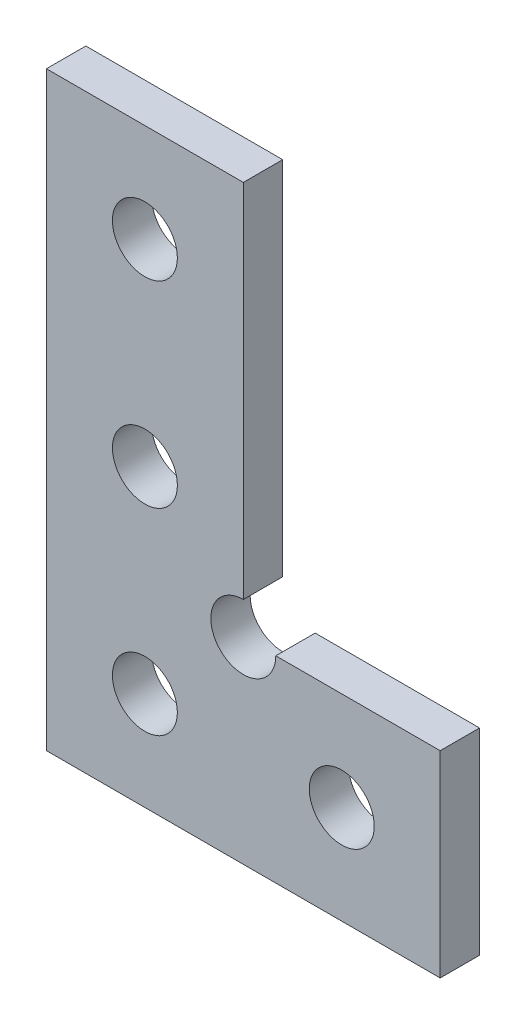
ISO-10303-21;
HEADER;
FILE_DESCRIPTION(('STEP AP214'),'2;1');
FILE_NAME('part.step','',(''),(''),'','','');
FILE_SCHEMA(('AUTOMOTIVE_DESIGN { 1 0 10303 214 1 1 1 1 }'));
ENDSEC;
DATA;
#1=APPLICATION_CONTEXT('core data for automotive mechanical design processes');
#2=APPLICATION_PROTOCOL_DEFINITION('international standard','automotive_design',2000,#1);
#3=PRODUCT_CONTEXT('',#1,'mechanical');
#4=PRODUCT('Part','Part','',(#3));
#5=PRODUCT_RELATED_PRODUCT_CATEGORY('part','',(#4));
#6=PRODUCT_DEFINITION_FORMATION('','',#4);
#7=PRODUCT_DEFINITION_CONTEXT('part definition',#1,'design');
#8=PRODUCT_DEFINITION('design','',#6,#7);
#9=PRODUCT_DEFINITION_SHAPE('','',#8);
#10=(LENGTH_UNIT() NAMED_UNIT(*) SI_UNIT(.MILLI.,.METRE.));
#11=(NAMED_UNIT(*) PLANE_ANGLE_UNIT() SI_UNIT($,.RADIAN.));
#12=(NAMED_UNIT(*) SI_UNIT($,.STERADIAN.) SOLID_ANGLE_UNIT());
#13=UNCERTAINTY_MEASURE_WITH_UNIT(LENGTH_MEASURE(1.E-05),#10,'distance_accuracy_value','');
#14=(GEOMETRIC_REPRESENTATION_CONTEXT(3) GLOBAL_UNCERTAINTY_ASSIGNED_CONTEXT((#13)) GLOBAL_UNIT_ASSIGNED_CONTEXT((#10,
#11,#12)) REPRESENTATION_CONTEXT('',''));
#15=CARTESIAN_POINT('',(0.,0.,0.));
#16=DIRECTION('',(0.,0.,1.));
#17=DIRECTION('',(1.,0.,0.));
#18=AXIS2_PLACEMENT_3D('',#15,#16,#17);
#19=CARTESIAN_POINT('',(0.,-5.,1.));
#20=DIRECTION('',(0.,0.,1.));
#21=DIRECTION('',(1.,0.,0.));
#22=AXIS2_PLACEMENT_3D('',#19,#20,#21);
#23=PLANE('',#22);
#24=CARTESIAN_POINT('',(5.,-10.,1.));
#25=DIRECTION('',(0.,0.,1.));
#26=DIRECTION('',(1.,0.,0.));
#27=AXIS2_PLACEMENT_3D('',#24,#25,#26);
#28=CIRCLE('',#27,1.65);
#29=CARTESIAN_POINT('',(6.65,-10.,1.));
#30=VERTEX_POINT('',#29);
#31=EDGE_CURVE('E171',#30,#30,#28,.T.);
#32=ORIENTED_EDGE('',*,*,#31,.F.);
#33=EDGE_LOOP('',(#32));
#34=FACE_BOUND('',#33,.T.);
#35=CARTESIAN_POINT('',(-5.,10.,1.));
#36=DIRECTION('',(0.,0.,1.));
#37=DIRECTION('',(1.,0.,0.));
#38=AXIS2_PLACEMENT_3D('',#35,#36,#37);
#39=CIRCLE('',#38,1.65);
#40=CARTESIAN_POINT('',(-3.35,10.,1.));
#41=VERTEX_POINT('',#40);
#42=EDGE_CURVE('E129',#41,#41,#39,.T.);
#43=ORIENTED_EDGE('',*,*,#42,.F.);
#44=EDGE_LOOP('',(#43));
#45=FACE_BOUND('',#44,.T.);
#46=DIRECTION('',(-1.,0.,0.));
#47=VECTOR('',#46,1.);
#48=CARTESIAN_POINT('',(-10.,15.,1.));
#49=LINE('',#48,#47);
#50=CARTESIAN_POINT('',(0.,15.,1.));
#51=VERTEX_POINT('',#50);
#52=CARTESIAN_POINT('',(-10.,15.,1.));
#53=VERTEX_POINT('',#52);
#54=EDGE_CURVE('E138',#51,#53,#49,.T.);
#55=ORIENTED_EDGE('',*,*,#54,.T.);
#56=DIRECTION('',(0.,-1.,0.));
#57=VECTOR('',#56,1.);
#58=CARTESIAN_POINT('',(-10.,15.,1.));
#59=LINE('',#58,#57);
#60=CARTESIAN_POINT('',(-10.,-15.,1.));
#61=VERTEX_POINT('',#60);
#62=EDGE_CURVE('E91',#53,#61,#59,.T.);
#63=ORIENTED_EDGE('',*,*,#62,.T.);
#64=DIRECTION('',(1.,0.,0.));
#65=VECTOR('',#64,1.);
#66=CARTESIAN_POINT('',(-10.,-15.,1.));
#67=LINE('',#66,#65);
#68=CARTESIAN_POINT('',(10.,-15.,1.));
#69=VERTEX_POINT('',#68);
#70=EDGE_CURVE('E150',#61,#69,#67,.T.);
#71=ORIENTED_EDGE('',*,*,#70,.T.);
#72=DIRECTION('',(0.,1.,0.));
#73=VECTOR('',#72,1.);
#74=CARTESIAN_POINT('',(10.,-15.,1.));
#75=LINE('',#74,#73);
#76=CARTESIAN_POINT('',(10.,-5.,1.));
#77=VERTEX_POINT('',#76);
#78=EDGE_CURVE('E107',#69,#77,#75,.T.);
#79=ORIENTED_EDGE('',*,*,#78,.T.);
#80=DIRECTION('',(-1.,0.,0.));
#81=VECTOR('',#80,1.);
#82=CARTESIAN_POINT('',(1.65,-5.,1.));
#83=LINE('',#82,#81);
#84=CARTESIAN_POINT('',(1.65,-5.,1.));
#85=VERTEX_POINT('',#84);
#86=EDGE_CURVE('E101',#77,#85,#83,.T.);
#87=ORIENTED_EDGE('',*,*,#86,.T.);
#88=CARTESIAN_POINT('',(0.,-5.,1.));
#89=DIRECTION('',(0.,0.,-1.));
#90=DIRECTION('',(1.,0.,0.));
#91=AXIS2_PLACEMENT_3D('',#88,#89,#90);
#92=CIRCLE('',#91,1.65);
#93=CARTESIAN_POINT('',(0.,-3.35,1.));
#94=VERTEX_POINT('',#93);
#95=EDGE_CURVE('E105',#85,#94,#92,.T.);
#96=ORIENTED_EDGE('',*,*,#95,.T.);
#97=DIRECTION('',(0.,1.,0.));
#98=VECTOR('',#97,1.);
#99=CARTESIAN_POINT('',(0.,15.,1.));
#100=LINE('',#99,#98);
#101=EDGE_CURVE('E51',#94,#51,#100,.T.);
#102=ORIENTED_EDGE('',*,*,#101,.T.);
#103=EDGE_LOOP('',(#55,#63,#71,#79,#87,#96,#102));
#104=FACE_BOUND('',#103,.T.);
#105=CARTESIAN_POINT('',(-5.,0.,1.));
#106=DIRECTION('',(0.,0.,1.));
#107=DIRECTION('',(1.,0.,0.));
#108=AXIS2_PLACEMENT_3D('',#105,#106,#107);
#109=CIRCLE('',#108,1.65);
#110=CARTESIAN_POINT('',(-3.35,0.,1.));
#111=VERTEX_POINT('',#110);
#112=EDGE_CURVE('E165',#111,#111,#109,.T.);
#113=ORIENTED_EDGE('',*,*,#112,.F.);
#114=EDGE_LOOP('',(#113));
#115=FACE_BOUND('',#114,.T.);
#116=CARTESIAN_POINT('',(-5.,-10.,1.));
#117=DIRECTION('',(0.,0.,1.));
#118=DIRECTION('',(1.,0.,0.));
#119=AXIS2_PLACEMENT_3D('',#116,#117,#118);
#120=CIRCLE('',#119,1.65);
#121=CARTESIAN_POINT('',(-3.35,-10.,1.));
#122=VERTEX_POINT('',#121);
#123=EDGE_CURVE('E177',#122,#122,#120,.T.);
#124=ORIENTED_EDGE('',*,*,#123,.F.);
#125=EDGE_LOOP('',(#124));
#126=FACE_BOUND('',#125,.T.);
#127=ADVANCED_FACE('F34',(#34,#45,#104,#115,#126),#23,.T.);
#128=CARTESIAN_POINT('',(0.,-5.,-1.));
#129=DIRECTION('',(0.,0.,1.));
#130=DIRECTION('',(1.,0.,0.));
#131=AXIS2_PLACEMENT_3D('',#128,#129,#130);
#132=PLANE('',#131);
#133=CARTESIAN_POINT('',(5.,-10.,-1.));
#134=DIRECTION('',(0.,0.,1.));
#135=DIRECTION('',(1.,0.,0.));
#136=AXIS2_PLACEMENT_3D('',#133,#134,#135);
#137=CIRCLE('',#136,1.65);
#138=CARTESIAN_POINT('',(6.65,-10.,-1.));
#139=VERTEX_POINT('',#138);
#140=EDGE_CURVE('E174',#139,#139,#137,.T.);
#141=ORIENTED_EDGE('',*,*,#140,.T.);
#142=EDGE_LOOP('',(#141));
#143=FACE_BOUND('',#142,.T.);
#144=CARTESIAN_POINT('',(-5.,10.,-1.));
#145=DIRECTION('',(0.,0.,1.));
#146=DIRECTION('',(1.,0.,0.));
#147=AXIS2_PLACEMENT_3D('',#144,#145,#146);
#148=CIRCLE('',#147,1.65);
#149=CARTESIAN_POINT('',(-3.35,10.,-1.));
#150=VERTEX_POINT('',#149);
#151=EDGE_CURVE('E162',#150,#150,#148,.T.);
#152=ORIENTED_EDGE('',*,*,#151,.T.);
#153=EDGE_LOOP('',(#152));
#154=FACE_BOUND('',#153,.T.);
#155=DIRECTION('',(-1.,0.,0.));
#156=VECTOR('',#155,1.);
#157=CARTESIAN_POINT('',(-10.,15.,-1.));
#158=LINE('',#157,#156);
#159=CARTESIAN_POINT('',(0.,15.,-1.));
#160=VERTEX_POINT('',#159);
#161=CARTESIAN_POINT('',(-10.,15.,-1.));
#162=VERTEX_POINT('',#161);
#163=EDGE_CURVE('E125',#160,#162,#158,.T.);
#164=ORIENTED_EDGE('',*,*,#163,.F.);
#165=DIRECTION('',(0.,1.,0.));
#166=VECTOR('',#165,1.);
#167=CARTESIAN_POINT('',(0.,15.,-1.));
#168=LINE('',#167,#166);
#169=CARTESIAN_POINT('',(0.,-3.35,-1.));
#170=VERTEX_POINT('',#169);
#171=EDGE_CURVE('E83',#170,#160,#168,.T.);
#172=ORIENTED_EDGE('',*,*,#171,.F.);
#173=CARTESIAN_POINT('',(0.,-5.,-1.));
#174=DIRECTION('',(0.,0.,-1.));
#175=DIRECTION('',(1.,0.,0.));
#176=AXIS2_PLACEMENT_3D('',#173,#174,#175);
#177=CIRCLE('',#176,1.65);
#178=CARTESIAN_POINT('',(1.65,-5.,-1.));
#179=VERTEX_POINT('',#178);
#180=EDGE_CURVE('E77',#179,#170,#177,.T.);
#181=ORIENTED_EDGE('',*,*,#180,.F.);
#182=DIRECTION('',(-1.,0.,0.));
#183=VECTOR('',#182,1.);
#184=CARTESIAN_POINT('',(1.65,-5.,-1.));
#185=LINE('',#184,#183);
#186=CARTESIAN_POINT('',(10.,-5.,-1.));
#187=VERTEX_POINT('',#186);
#188=EDGE_CURVE('E115',#187,#179,#185,.T.);
#189=ORIENTED_EDGE('',*,*,#188,.F.);
#190=DIRECTION('',(0.,1.,0.));
#191=VECTOR('',#190,1.);
#192=CARTESIAN_POINT('',(10.,-15.,-1.));
#193=LINE('',#192,#191);
#194=CARTESIAN_POINT('',(10.,-15.,-1.));
#195=VERTEX_POINT('',#194);
#196=EDGE_CURVE('E133',#195,#187,#193,.T.);
#197=ORIENTED_EDGE('',*,*,#196,.F.);
#198=DIRECTION('',(1.,0.,0.));
#199=VECTOR('',#198,1.);
#200=CARTESIAN_POINT('',(-10.,-15.,-1.));
#201=LINE('',#200,#199);
#202=CARTESIAN_POINT('',(-10.,-15.,-1.));
#203=VERTEX_POINT('',#202);
#204=EDGE_CURVE('E131',#203,#195,#201,.T.);
#205=ORIENTED_EDGE('',*,*,#204,.F.);
#206=DIRECTION('',(0.,-1.,0.));
#207=VECTOR('',#206,1.);
#208=CARTESIAN_POINT('',(-10.,15.,-1.));
#209=LINE('',#208,#207);
#210=EDGE_CURVE('E128',#162,#203,#209,.T.);
#211=ORIENTED_EDGE('',*,*,#210,.F.);
#212=EDGE_LOOP('',(#164,#172,#181,#189,#197,#205,#211));
#213=FACE_BOUND('',#212,.T.);
#214=CARTESIAN_POINT('',(-5.,0.,-1.));
#215=DIRECTION('',(0.,0.,1.));
#216=DIRECTION('',(1.,0.,0.));
#217=AXIS2_PLACEMENT_3D('',#214,#215,#216);
#218=CIRCLE('',#217,1.65);
#219=CARTESIAN_POINT('',(-3.35,0.,-1.));
#220=VERTEX_POINT('',#219);
#221=EDGE_CURVE('E168',#220,#220,#218,.T.);
#222=ORIENTED_EDGE('',*,*,#221,.T.);
#223=EDGE_LOOP('',(#222));
#224=FACE_BOUND('',#223,.T.);
#225=CARTESIAN_POINT('',(-5.,-10.,-1.));
#226=DIRECTION('',(0.,0.,1.));
#227=DIRECTION('',(1.,0.,0.));
#228=AXIS2_PLACEMENT_3D('',#225,#226,#227);
#229=CIRCLE('',#228,1.65);
#230=CARTESIAN_POINT('',(-3.35,-10.,-1.));
#231=VERTEX_POINT('',#230);
#232=EDGE_CURVE('E180',#231,#231,#229,.T.);
#233=ORIENTED_EDGE('',*,*,#232,.T.);
#234=EDGE_LOOP('',(#233));
#235=FACE_BOUND('',#234,.T.);
#236=ADVANCED_FACE('F154',(#143,#154,#213,#224,#235),#132,.F.);
#237=CARTESIAN_POINT('',(-10.,15.,1.));
#238=DIRECTION('',(0.,-1.,0.));
#239=DIRECTION('',(1.,0.,0.));
#240=AXIS2_PLACEMENT_3D('',#237,#238,#239);
#241=PLANE('',#240);
#242=ORIENTED_EDGE('',*,*,#163,.T.);
#243=DIRECTION('',(0.,0.,-1.));
#244=VECTOR('',#243,1.);
#245=CARTESIAN_POINT('',(-10.,15.,1.));
#246=LINE('',#245,#244);
#247=EDGE_CURVE('E11',#53,#162,#246,.T.);
#248=ORIENTED_EDGE('',*,*,#247,.F.);
#249=ORIENTED_EDGE('',*,*,#54,.F.);
#250=DIRECTION('',(0.,0.,-1.));
#251=VECTOR('',#250,1.);
#252=CARTESIAN_POINT('',(0.,15.,1.));
#253=LINE('',#252,#251);
#254=EDGE_CURVE('E121',#51,#160,#253,.T.);
#255=ORIENTED_EDGE('',*,*,#254,.T.);
#256=EDGE_LOOP('',(#242,#248,#249,#255));
#257=FACE_BOUND('',#256,.T.);
#258=ADVANCED_FACE('F36',(#257),#241,.F.);
#259=CARTESIAN_POINT('',(-10.,15.,1.));
#260=DIRECTION('',(1.,0.,0.));
#261=DIRECTION('',(0.,1.,0.));
#262=AXIS2_PLACEMENT_3D('',#259,#260,#261);
#263=PLANE('',#262);
#264=ORIENTED_EDGE('',*,*,#210,.T.);
#265=DIRECTION('',(0.,0.,-1.));
#266=VECTOR('',#265,1.);
#267=CARTESIAN_POINT('',(-10.,-15.,1.));
#268=LINE('',#267,#266);
#269=EDGE_CURVE('E43',#61,#203,#268,.T.);
#270=ORIENTED_EDGE('',*,*,#269,.F.);
#271=ORIENTED_EDGE('',*,*,#62,.F.);
#272=ORIENTED_EDGE('',*,*,#247,.T.);
#273=EDGE_LOOP('',(#264,#270,#271,#272));
#274=FACE_BOUND('',#273,.T.);
#275=ADVANCED_FACE('F213',(#274),#263,.F.);
#276=CARTESIAN_POINT('',(-10.,-15.,1.));
#277=DIRECTION('',(0.,1.,0.));
#278=DIRECTION('',(0.,0.,1.));
#279=AXIS2_PLACEMENT_3D('',#276,#277,#278);
#280=PLANE('',#279);
#281=ORIENTED_EDGE('',*,*,#204,.T.);
#282=DIRECTION('',(0.,0.,-1.));
#283=VECTOR('',#282,1.);
#284=CARTESIAN_POINT('',(10.,-15.,1.));
#285=LINE('',#284,#283);
#286=EDGE_CURVE('E142',#69,#195,#285,.T.);
#287=ORIENTED_EDGE('',*,*,#286,.F.);
#288=ORIENTED_EDGE('',*,*,#70,.F.);
#289=ORIENTED_EDGE('',*,*,#269,.T.);
#290=EDGE_LOOP('',(#281,#287,#288,#289));
#291=FACE_BOUND('',#290,.T.);
#292=ADVANCED_FACE('F148',(#291),#280,.F.);
#293=CARTESIAN_POINT('',(10.,-15.,1.));
#294=DIRECTION('',(-1.,0.,0.));
#295=DIRECTION('',(0.,0.,1.));
#296=AXIS2_PLACEMENT_3D('',#293,#294,#295);
#297=PLANE('',#296);
#298=ORIENTED_EDGE('',*,*,#196,.T.);
#299=DIRECTION('',(0.,0.,-1.));
#300=VECTOR('',#299,1.);
#301=CARTESIAN_POINT('',(10.,-5.,1.));
#302=LINE('',#301,#300);
#303=EDGE_CURVE('E116',#77,#187,#302,.T.);
#304=ORIENTED_EDGE('',*,*,#303,.F.);
#305=ORIENTED_EDGE('',*,*,#78,.F.);
#306=ORIENTED_EDGE('',*,*,#286,.T.);
#307=EDGE_LOOP('',(#298,#304,#305,#306));
#308=FACE_BOUND('',#307,.T.);
#309=ADVANCED_FACE('F157',(#308),#297,.F.);
#310=CARTESIAN_POINT('',(1.65,-5.,1.));
#311=DIRECTION('',(0.,-1.,0.));
#312=DIRECTION('',(1.,0.,0.));
#313=AXIS2_PLACEMENT_3D('',#310,#311,#312);
#314=PLANE('',#313);
#315=ORIENTED_EDGE('',*,*,#188,.T.);
#316=DIRECTION('',(0.,0.,-1.));
#317=VECTOR('',#316,1.);
#318=CARTESIAN_POINT('',(1.65,-5.,1.));
#319=LINE('',#318,#317);
#320=EDGE_CURVE('E112',#85,#179,#319,.T.);
#321=ORIENTED_EDGE('',*,*,#320,.F.);
#322=ORIENTED_EDGE('',*,*,#86,.F.);
#323=ORIENTED_EDGE('',*,*,#303,.T.);
#324=EDGE_LOOP('',(#315,#321,#322,#323));
#325=FACE_BOUND('',#324,.T.);
#326=ADVANCED_FACE('F113',(#325),#314,.F.);
#327=CARTESIAN_POINT('',(0.,-5.,1.));
#328=DIRECTION('',(0.,0.,-1.));
#329=DIRECTION('',(-1.,0.,0.));
#330=AXIS2_PLACEMENT_3D('',#327,#328,#329);
#331=CYLINDRICAL_SURFACE('',#330,1.65);
#332=ORIENTED_EDGE('',*,*,#180,.T.);
#333=DIRECTION('',(0.,0.,-1.));
#334=VECTOR('',#333,1.);
#335=CARTESIAN_POINT('',(0.,-3.35,1.));
#336=LINE('',#335,#334);
#337=EDGE_CURVE('E117',#94,#170,#336,.T.);
#338=ORIENTED_EDGE('',*,*,#337,.F.);
#339=ORIENTED_EDGE('',*,*,#95,.F.);
#340=ORIENTED_EDGE('',*,*,#320,.T.);
#341=EDGE_LOOP('',(#332,#338,#339,#340));
#342=FACE_BOUND('',#341,.T.);
#343=ADVANCED_FACE('F119',(#342),#331,.F.);
#344=CARTESIAN_POINT('',(0.,15.,1.));
#345=DIRECTION('',(-1.,0.,0.));
#346=DIRECTION('',(0.,-1.,0.));
#347=AXIS2_PLACEMENT_3D('',#344,#345,#346);
#348=PLANE('',#347);
#349=ORIENTED_EDGE('',*,*,#171,.T.);
#350=ORIENTED_EDGE('',*,*,#254,.F.);
#351=ORIENTED_EDGE('',*,*,#101,.F.);
#352=ORIENTED_EDGE('',*,*,#337,.T.);
#353=EDGE_LOOP('',(#349,#350,#351,#352));
#354=FACE_BOUND('',#353,.T.);
#355=ADVANCED_FACE('F203',(#354),#348,.F.);
#356=CARTESIAN_POINT('',(-5.,10.,1.));
#357=DIRECTION('',(0.,0.,-1.));
#358=DIRECTION('',(-1.,0.,0.));
#359=AXIS2_PLACEMENT_3D('',#356,#357,#358);
#360=CYLINDRICAL_SURFACE('',#359,1.65);
#361=ORIENTED_EDGE('',*,*,#42,.T.);
#362=EDGE_LOOP('',(#361));
#363=FACE_BOUND('',#362,.T.);
#364=ORIENTED_EDGE('',*,*,#151,.F.);
#365=EDGE_LOOP('',(#364));
#366=FACE_BOUND('',#365,.T.);
#367=ADVANCED_FACE('F200',(#363,#366),#360,.F.);
#368=CARTESIAN_POINT('',(-5.,0.,1.));
#369=DIRECTION('',(0.,0.,-1.));
#370=DIRECTION('',(-1.,0.,0.));
#371=AXIS2_PLACEMENT_3D('',#368,#369,#370);
#372=CYLINDRICAL_SURFACE('',#371,1.65);
#373=ORIENTED_EDGE('',*,*,#112,.T.);
#374=EDGE_LOOP('',(#373));
#375=FACE_BOUND('',#374,.T.);
#376=ORIENTED_EDGE('',*,*,#221,.F.);
#377=EDGE_LOOP('',(#376));
#378=FACE_BOUND('',#377,.T.);
#379=ADVANCED_FACE('F272',(#375,#378),#372,.F.);
#380=CARTESIAN_POINT('',(5.,-10.,1.));
#381=DIRECTION('',(0.,0.,-1.));
#382=DIRECTION('',(-1.,0.,0.));
#383=AXIS2_PLACEMENT_3D('',#380,#381,#382);
#384=CYLINDRICAL_SURFACE('',#383,1.65);
#385=ORIENTED_EDGE('',*,*,#31,.T.);
#386=EDGE_LOOP('',(#385));
#387=FACE_BOUND('',#386,.T.);
#388=ORIENTED_EDGE('',*,*,#140,.F.);
#389=EDGE_LOOP('',(#388));
#390=FACE_BOUND('',#389,.T.);
#391=ADVANCED_FACE('F280',(#387,#390),#384,.F.);
#392=CARTESIAN_POINT('',(-5.,-10.,1.));
#393=DIRECTION('',(0.,0.,-1.));
#394=DIRECTION('',(-1.,0.,0.));
#395=AXIS2_PLACEMENT_3D('',#392,#393,#394);
#396=CYLINDRICAL_SURFACE('',#395,1.65);
#397=ORIENTED_EDGE('',*,*,#123,.T.);
#398=EDGE_LOOP('',(#397));
#399=FACE_BOUND('',#398,.T.);
#400=ORIENTED_EDGE('',*,*,#232,.F.);
#401=EDGE_LOOP('',(#400));
#402=FACE_BOUND('',#401,.T.);
#403=ADVANCED_FACE('F186',(#399,#402),#396,.F.);
#404=CLOSED_SHELL('',(#127,#236,#258,#275,#292,#309,#326,#343,#355,#367,#379,#391,#403));
#405=MANIFOLD_SOLID_BREP('B2',#404);
#406=ADVANCED_BREP_SHAPE_REPRESENTATION('',(#18,#405),#14);
#407=SHAPE_DEFINITION_REPRESENTATION(#9,#406);
ENDSEC;
END-ISO-10303-21;
